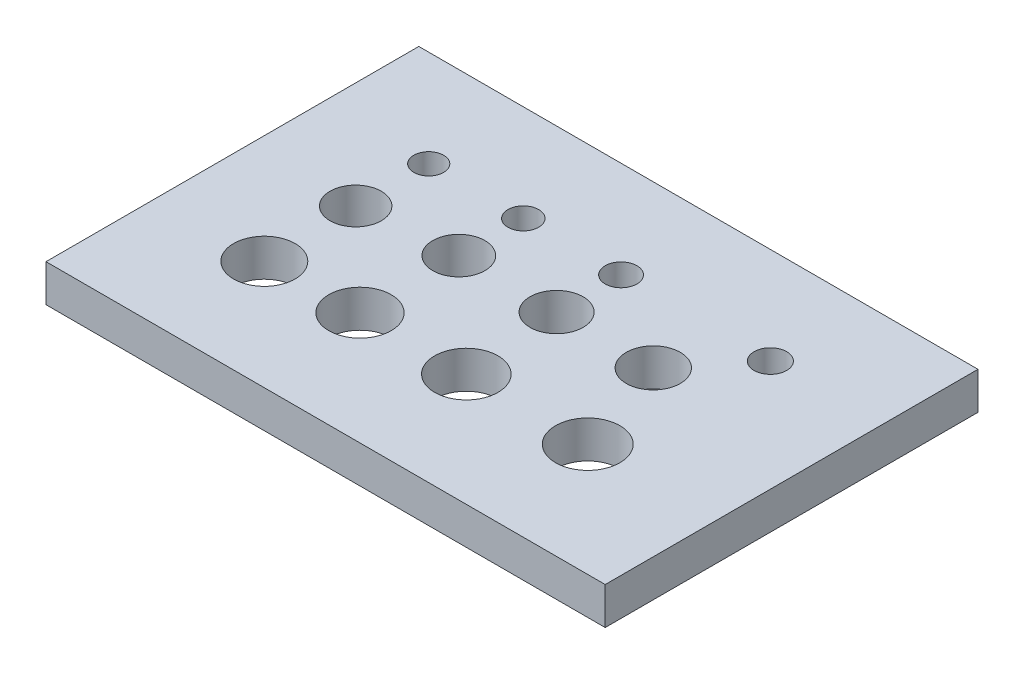
ISO-10303-21;
HEADER;
FILE_DESCRIPTION(('STEP AP214'),'2;1');
FILE_NAME('part.step','',(''),(''),'','','');
FILE_SCHEMA(('AUTOMOTIVE_DESIGN { 1 0 10303 214 1 1 1 1 }'));
ENDSEC;
DATA;
#1=APPLICATION_CONTEXT('core data for automotive mechanical design processes');
#2=APPLICATION_PROTOCOL_DEFINITION('international standard','automotive_design',2000,#1);
#3=PRODUCT_CONTEXT('',#1,'mechanical');
#4=PRODUCT('Part','Part','',(#3));
#5=PRODUCT_RELATED_PRODUCT_CATEGORY('part','',(#4));
#6=PRODUCT_DEFINITION_FORMATION('','',#4);
#7=PRODUCT_DEFINITION_CONTEXT('part definition',#1,'design');
#8=PRODUCT_DEFINITION('design','',#6,#7);
#9=PRODUCT_DEFINITION_SHAPE('','',#8);
#10=(LENGTH_UNIT() NAMED_UNIT(*) SI_UNIT(.MILLI.,.METRE.));
#11=(NAMED_UNIT(*) PLANE_ANGLE_UNIT() SI_UNIT($,.RADIAN.));
#12=(NAMED_UNIT(*) SI_UNIT($,.STERADIAN.) SOLID_ANGLE_UNIT());
#13=UNCERTAINTY_MEASURE_WITH_UNIT(LENGTH_MEASURE(1.E-05),#10,'distance_accuracy_value','');
#14=(GEOMETRIC_REPRESENTATION_CONTEXT(3) GLOBAL_UNCERTAINTY_ASSIGNED_CONTEXT((#13)) GLOBAL_UNIT_ASSIGNED_CONTEXT((#10,
#11,#12)) REPRESENTATION_CONTEXT('',''));
#15=CARTESIAN_POINT('',(0.,0.,0.));
#16=DIRECTION('',(0.,0.,1.));
#17=DIRECTION('',(1.,0.,0.));
#18=AXIS2_PLACEMENT_3D('',#15,#16,#17);
#19=CARTESIAN_POINT('',(0.,2.,0.));
#20=DIRECTION('',(0.,1.,0.));
#21=DIRECTION('',(0.,0.,1.));
#22=AXIS2_PLACEMENT_3D('',#19,#20,#21);
#23=PLANE('',#22);
#24=CARTESIAN_POINT('',(1.4985590778098,2.,3.94812680115274));
#25=DIRECTION('',(0.,1.,0.));
#26=DIRECTION('',(0.,0.,1.));
#27=AXIS2_PLACEMENT_3D('',#24,#25,#26);
#28=CIRCLE('',#27,1.7);
#29=CARTESIAN_POINT('',(1.4985590778098,2.,5.64812680115274));
#30=VERTEX_POINT('',#29);
#31=EDGE_CURVE('E175',#30,#30,#28,.T.);
#32=ORIENTED_EDGE('',*,*,#31,.F.);
#33=EDGE_LOOP('',(#32));
#34=FACE_BOUND('',#33,.T.);
#35=CARTESIAN_POINT('',(-9.1617638584646,2.,4.12478937080454));
#36=DIRECTION('',(0.,1.,0.));
#37=DIRECTION('',(0.,0.,1.));
#38=AXIS2_PLACEMENT_3D('',#35,#36,#37);
#39=CIRCLE('',#38,1.65);
#40=CARTESIAN_POINT('',(-9.1617638584646,2.,5.77478937080454));
#41=VERTEX_POINT('',#40);
#42=EDGE_CURVE('E163',#41,#41,#39,.T.);
#43=ORIENTED_EDGE('',*,*,#42,.F.);
#44=EDGE_LOOP('',(#43));
#45=FACE_BOUND('',#44,.T.);
#46=CARTESIAN_POINT('',(-9.27953890489914,2.,-0.89337175792507));
#47=DIRECTION('',(0.,1.,0.));
#48=DIRECTION('',(0.,0.,1.));
#49=AXIS2_PLACEMENT_3D('',#46,#47,#48);
#50=CIRCLE('',#49,1.375);
#51=CARTESIAN_POINT('',(-9.27953890489914,2.,0.481628242074929));
#52=VERTEX_POINT('',#51);
#53=EDGE_CURVE('E151',#52,#52,#50,.T.);
#54=ORIENTED_EDGE('',*,*,#53,.F.);
#55=EDGE_LOOP('',(#54));
#56=FACE_BOUND('',#55,.T.);
#57=CARTESIAN_POINT('',(-4.20749279538905,2.,-1.35446685878962));
#58=DIRECTION('',(0.,1.,0.));
#59=DIRECTION('',(0.,0.,1.));
#60=AXIS2_PLACEMENT_3D('',#57,#58,#59);
#61=CIRCLE('',#60,1.4);
#62=CARTESIAN_POINT('',(-4.20749279538905,2.,0.0455331412103754));
#63=VERTEX_POINT('',#62);
#64=EDGE_CURVE('E139',#63,#63,#61,.T.);
#65=ORIENTED_EDGE('',*,*,#64,.F.);
#66=EDGE_LOOP('',(#65));
#67=FACE_BOUND('',#66,.T.);
#68=CARTESIAN_POINT('',(1.03746397694524,2.,-4.81268011527377));
#69=DIRECTION('',(0.,1.,0.));
#70=DIRECTION('',(0.,0.,1.));
#71=AXIS2_PLACEMENT_3D('',#68,#69,#70);
#72=CIRCLE('',#71,0.85);
#73=CARTESIAN_POINT('',(1.03746397694524,2.,-3.96268011527377));
#74=VERTEX_POINT('',#73);
#75=EDGE_CURVE('E127',#74,#74,#72,.T.);
#76=ORIENTED_EDGE('',*,*,#75,.F.);
#77=EDGE_LOOP('',(#76));
#78=FACE_BOUND('',#77,.T.);
#79=CARTESIAN_POINT('',(-9.27953890489914,2.,-4.81268011527377));
#80=DIRECTION('',(0.,1.,0.));
#81=DIRECTION('',(0.,0.,1.));
#82=AXIS2_PLACEMENT_3D('',#79,#80,#81);
#83=CIRCLE('',#82,0.800000000000001);
#84=CARTESIAN_POINT('',(-9.27953890489914,2.,-4.01268011527377));
#85=VERTEX_POINT('',#84);
#86=EDGE_CURVE('E106',#85,#85,#83,.T.);
#87=ORIENTED_EDGE('',*,*,#86,.F.);
#88=EDGE_LOOP('',(#87));
#89=FACE_BOUND('',#88,.T.);
#90=DIRECTION('',(0.,0.,-1.));
#91=VECTOR('',#90,1.);
#92=CARTESIAN_POINT('',(15.,2.,-10.));
#93=LINE('',#92,#91);
#94=CARTESIAN_POINT('',(15.,2.,10.));
#95=VERTEX_POINT('',#94);
#96=CARTESIAN_POINT('',(15.,2.,-10.));
#97=VERTEX_POINT('',#96);
#98=EDGE_CURVE('E91',#95,#97,#93,.T.);
#99=ORIENTED_EDGE('',*,*,#98,.T.);
#100=DIRECTION('',(-1.,0.,0.));
#101=VECTOR('',#100,1.);
#102=CARTESIAN_POINT('',(-15.,2.,-10.));
#103=LINE('',#102,#101);
#104=CARTESIAN_POINT('',(-15.,2.,-10.));
#105=VERTEX_POINT('',#104);
#106=EDGE_CURVE('E86',#97,#105,#103,.T.);
#107=ORIENTED_EDGE('',*,*,#106,.T.);
#108=DIRECTION('',(0.,0.,1.));
#109=VECTOR('',#108,1.);
#110=CARTESIAN_POINT('',(-15.,2.,-10.));
#111=LINE('',#110,#109);
#112=CARTESIAN_POINT('',(-15.,2.,10.));
#113=VERTEX_POINT('',#112);
#114=EDGE_CURVE('E89',#105,#113,#111,.T.);
#115=ORIENTED_EDGE('',*,*,#114,.T.);
#116=DIRECTION('',(1.,0.,0.));
#117=VECTOR('',#116,1.);
#118=CARTESIAN_POINT('',(-15.,2.,10.));
#119=LINE('',#118,#117);
#120=EDGE_CURVE('E56',#113,#95,#119,.T.);
#121=ORIENTED_EDGE('',*,*,#120,.T.);
#122=EDGE_LOOP('',(#99,#107,#115,#121));
#123=FACE_BOUND('',#122,.T.);
#124=CARTESIAN_POINT('',(-4.20749279538905,2.,-4.81268011527377));
#125=DIRECTION('',(0.,1.,0.));
#126=DIRECTION('',(0.,0.,1.));
#127=AXIS2_PLACEMENT_3D('',#124,#125,#126);
#128=CIRCLE('',#127,0.825);
#129=CARTESIAN_POINT('',(-4.20749279538905,2.,-3.98768011527377));
#130=VERTEX_POINT('',#129);
#131=EDGE_CURVE('E121',#130,#130,#128,.T.);
#132=ORIENTED_EDGE('',*,*,#131,.F.);
#133=EDGE_LOOP('',(#132));
#134=FACE_BOUND('',#133,.T.);
#135=CARTESIAN_POINT('',(9.04899135446685,2.,-4.81268011527377));
#136=DIRECTION('',(0.,1.,0.));
#137=DIRECTION('',(0.,0.,1.));
#138=AXIS2_PLACEMENT_3D('',#135,#136,#137);
#139=CIRCLE('',#138,0.875);
#140=CARTESIAN_POINT('',(9.04899135446685,2.,-3.93768011527377));
#141=VERTEX_POINT('',#140);
#142=EDGE_CURVE('E133',#141,#141,#139,.T.);
#143=ORIENTED_EDGE('',*,*,#142,.F.);
#144=EDGE_LOOP('',(#143));
#145=FACE_BOUND('',#144,.T.);
#146=CARTESIAN_POINT('',(1.03746397694524,2.,-1.35446685878962));
#147=DIRECTION('',(0.,1.,0.));
#148=DIRECTION('',(0.,0.,1.));
#149=AXIS2_PLACEMENT_3D('',#146,#147,#148);
#150=CIRCLE('',#149,1.425);
#151=CARTESIAN_POINT('',(1.03746397694524,2.,0.0705331412103752));
#152=VERTEX_POINT('',#151);
#153=EDGE_CURVE('E145',#152,#152,#150,.T.);
#154=ORIENTED_EDGE('',*,*,#153,.F.);
#155=EDGE_LOOP('',(#154));
#156=FACE_BOUND('',#155,.T.);
#157=CARTESIAN_POINT('',(6.22478386167147,2.,-1.35446685878962));
#158=DIRECTION('',(0.,1.,0.));
#159=DIRECTION('',(0.,0.,1.));
#160=AXIS2_PLACEMENT_3D('',#157,#158,#159);
#161=CIRCLE('',#160,1.45);
#162=CARTESIAN_POINT('',(6.22478386167147,2.,0.0955331412103751));
#163=VERTEX_POINT('',#162);
#164=EDGE_CURVE('E157',#163,#163,#161,.T.);
#165=ORIENTED_EDGE('',*,*,#164,.F.);
#166=EDGE_LOOP('',(#165));
#167=FACE_BOUND('',#166,.T.);
#168=CARTESIAN_POINT('',(-4.20749279538905,2.,3.94812680115274));
#169=DIRECTION('',(0.,1.,0.));
#170=DIRECTION('',(0.,0.,1.));
#171=AXIS2_PLACEMENT_3D('',#168,#169,#170);
#172=CIRCLE('',#171,1.675);
#173=CARTESIAN_POINT('',(-4.20749279538905,2.,5.62312680115274));
#174=VERTEX_POINT('',#173);
#175=EDGE_CURVE('E169',#174,#174,#172,.T.);
#176=ORIENTED_EDGE('',*,*,#175,.F.);
#177=EDGE_LOOP('',(#176));
#178=FACE_BOUND('',#177,.T.);
#179=CARTESIAN_POINT('',(8.01152737752161,2.,3.94812680115274));
#180=DIRECTION('',(0.,1.,0.));
#181=DIRECTION('',(0.,0.,1.));
#182=AXIS2_PLACEMENT_3D('',#179,#180,#181);
#183=CIRCLE('',#182,1.725);
#184=CARTESIAN_POINT('',(8.01152737752161,2.,5.67312680115274));
#185=VERTEX_POINT('',#184);
#186=EDGE_CURVE('E181',#185,#185,#183,.T.);
#187=ORIENTED_EDGE('',*,*,#186,.F.);
#188=EDGE_LOOP('',(#187));
#189=FACE_BOUND('',#188,.T.);
#190=ADVANCED_FACE('F39',(#34,#45,#56,#67,#78,#89,#123,#134,#145,#156,#167,#178,#189),#23,.T.);
#191=CARTESIAN_POINT('',(0.,0.,0.));
#192=DIRECTION('',(0.,1.,0.));
#193=DIRECTION('',(0.,0.,1.));
#194=AXIS2_PLACEMENT_3D('',#191,#192,#193);
#195=PLANE('',#194);
#196=DIRECTION('',(0.,0.,-1.));
#197=VECTOR('',#196,1.);
#198=CARTESIAN_POINT('',(15.,0.,-10.));
#199=LINE('',#198,#197);
#200=CARTESIAN_POINT('',(15.,0.,10.));
#201=VERTEX_POINT('',#200);
#202=CARTESIAN_POINT('',(15.,0.,-10.));
#203=VERTEX_POINT('',#202);
#204=EDGE_CURVE('E103',#201,#203,#199,.T.);
#205=ORIENTED_EDGE('',*,*,#204,.F.);
#206=DIRECTION('',(1.,0.,0.));
#207=VECTOR('',#206,1.);
#208=CARTESIAN_POINT('',(-15.,0.,10.));
#209=LINE('',#208,#207);
#210=CARTESIAN_POINT('',(-15.,0.,10.));
#211=VERTEX_POINT('',#210);
#212=EDGE_CURVE('E79',#211,#201,#209,.T.);
#213=ORIENTED_EDGE('',*,*,#212,.F.);
#214=DIRECTION('',(0.,0.,1.));
#215=VECTOR('',#214,1.);
#216=CARTESIAN_POINT('',(-15.,0.,-10.));
#217=LINE('',#216,#215);
#218=CARTESIAN_POINT('',(-15.,0.,-10.));
#219=VERTEX_POINT('',#218);
#220=EDGE_CURVE('E73',#219,#211,#217,.T.);
#221=ORIENTED_EDGE('',*,*,#220,.F.);
#222=DIRECTION('',(-1.,0.,0.));
#223=VECTOR('',#222,1.);
#224=CARTESIAN_POINT('',(-15.,0.,-10.));
#225=LINE('',#224,#223);
#226=EDGE_CURVE('E95',#203,#219,#225,.T.);
#227=ORIENTED_EDGE('',*,*,#226,.F.);
#228=EDGE_LOOP('',(#205,#213,#221,#227));
#229=FACE_BOUND('',#228,.T.);
#230=CARTESIAN_POINT('',(-9.27953890489914,0.,-4.81268011527377));
#231=DIRECTION('',(0.,1.,0.));
#232=DIRECTION('',(0.,0.,1.));
#233=AXIS2_PLACEMENT_3D('',#230,#231,#232);
#234=CIRCLE('',#233,0.800000000000001);
#235=CARTESIAN_POINT('',(-9.27953890489914,0.,-4.01268011527377));
#236=VERTEX_POINT('',#235);
#237=EDGE_CURVE('E118',#236,#236,#234,.T.);
#238=ORIENTED_EDGE('',*,*,#237,.T.);
#239=EDGE_LOOP('',(#238));
#240=FACE_BOUND('',#239,.T.);
#241=CARTESIAN_POINT('',(-4.20749279538905,0.,-4.81268011527377));
#242=DIRECTION('',(0.,1.,0.));
#243=DIRECTION('',(0.,0.,1.));
#244=AXIS2_PLACEMENT_3D('',#241,#242,#243);
#245=CIRCLE('',#244,0.825);
#246=CARTESIAN_POINT('',(-4.20749279538905,0.,-3.98768011527377));
#247=VERTEX_POINT('',#246);
#248=EDGE_CURVE('E124',#247,#247,#245,.T.);
#249=ORIENTED_EDGE('',*,*,#248,.T.);
#250=EDGE_LOOP('',(#249));
#251=FACE_BOUND('',#250,.T.);
#252=CARTESIAN_POINT('',(1.03746397694524,0.,-4.81268011527377));
#253=DIRECTION('',(0.,1.,0.));
#254=DIRECTION('',(0.,0.,1.));
#255=AXIS2_PLACEMENT_3D('',#252,#253,#254);
#256=CIRCLE('',#255,0.85);
#257=CARTESIAN_POINT('',(1.03746397694524,0.,-3.96268011527377));
#258=VERTEX_POINT('',#257);
#259=EDGE_CURVE('E130',#258,#258,#256,.T.);
#260=ORIENTED_EDGE('',*,*,#259,.T.);
#261=EDGE_LOOP('',(#260));
#262=FACE_BOUND('',#261,.T.);
#263=CARTESIAN_POINT('',(9.04899135446685,0.,-4.81268011527377));
#264=DIRECTION('',(0.,1.,0.));
#265=DIRECTION('',(0.,0.,1.));
#266=AXIS2_PLACEMENT_3D('',#263,#264,#265);
#267=CIRCLE('',#266,0.875);
#268=CARTESIAN_POINT('',(9.04899135446685,0.,-3.93768011527377));
#269=VERTEX_POINT('',#268);
#270=EDGE_CURVE('E136',#269,#269,#267,.T.);
#271=ORIENTED_EDGE('',*,*,#270,.T.);
#272=EDGE_LOOP('',(#271));
#273=FACE_BOUND('',#272,.T.);
#274=CARTESIAN_POINT('',(-4.20749279538905,0.,-1.35446685878962));
#275=DIRECTION('',(0.,1.,0.));
#276=DIRECTION('',(0.,0.,1.));
#277=AXIS2_PLACEMENT_3D('',#274,#275,#276);
#278=CIRCLE('',#277,1.4);
#279=CARTESIAN_POINT('',(-4.20749279538905,0.,0.0455331412103754));
#280=VERTEX_POINT('',#279);
#281=EDGE_CURVE('E142',#280,#280,#278,.T.);
#282=ORIENTED_EDGE('',*,*,#281,.T.);
#283=EDGE_LOOP('',(#282));
#284=FACE_BOUND('',#283,.T.);
#285=CARTESIAN_POINT('',(1.03746397694524,0.,-1.35446685878962));
#286=DIRECTION('',(0.,1.,0.));
#287=DIRECTION('',(0.,0.,1.));
#288=AXIS2_PLACEMENT_3D('',#285,#286,#287);
#289=CIRCLE('',#288,1.425);
#290=CARTESIAN_POINT('',(1.03746397694524,0.,0.0705331412103752));
#291=VERTEX_POINT('',#290);
#292=EDGE_CURVE('E148',#291,#291,#289,.T.);
#293=ORIENTED_EDGE('',*,*,#292,.T.);
#294=EDGE_LOOP('',(#293));
#295=FACE_BOUND('',#294,.T.);
#296=CARTESIAN_POINT('',(-9.27953890489914,0.,-0.89337175792507));
#297=DIRECTION('',(0.,1.,0.));
#298=DIRECTION('',(0.,0.,1.));
#299=AXIS2_PLACEMENT_3D('',#296,#297,#298);
#300=CIRCLE('',#299,1.375);
#301=CARTESIAN_POINT('',(-9.27953890489914,0.,0.481628242074929));
#302=VERTEX_POINT('',#301);
#303=EDGE_CURVE('E154',#302,#302,#300,.T.);
#304=ORIENTED_EDGE('',*,*,#303,.T.);
#305=EDGE_LOOP('',(#304));
#306=FACE_BOUND('',#305,.T.);
#307=CARTESIAN_POINT('',(6.22478386167147,0.,-1.35446685878962));
#308=DIRECTION('',(0.,1.,0.));
#309=DIRECTION('',(0.,0.,1.));
#310=AXIS2_PLACEMENT_3D('',#307,#308,#309);
#311=CIRCLE('',#310,1.45);
#312=CARTESIAN_POINT('',(6.22478386167147,0.,0.0955331412103751));
#313=VERTEX_POINT('',#312);
#314=EDGE_CURVE('E160',#313,#313,#311,.T.);
#315=ORIENTED_EDGE('',*,*,#314,.T.);
#316=EDGE_LOOP('',(#315));
#317=FACE_BOUND('',#316,.T.);
#318=CARTESIAN_POINT('',(-9.1617638584646,0.,4.12478937080454));
#319=DIRECTION('',(0.,1.,0.));
#320=DIRECTION('',(0.,0.,1.));
#321=AXIS2_PLACEMENT_3D('',#318,#319,#320);
#322=CIRCLE('',#321,1.65);
#323=CARTESIAN_POINT('',(-9.1617638584646,0.,5.77478937080454));
#324=VERTEX_POINT('',#323);
#325=EDGE_CURVE('E166',#324,#324,#322,.T.);
#326=ORIENTED_EDGE('',*,*,#325,.T.);
#327=EDGE_LOOP('',(#326));
#328=FACE_BOUND('',#327,.T.);
#329=CARTESIAN_POINT('',(-4.20749279538905,0.,3.94812680115274));
#330=DIRECTION('',(0.,1.,0.));
#331=DIRECTION('',(0.,0.,1.));
#332=AXIS2_PLACEMENT_3D('',#329,#330,#331);
#333=CIRCLE('',#332,1.675);
#334=CARTESIAN_POINT('',(-4.20749279538905,0.,5.62312680115274));
#335=VERTEX_POINT('',#334);
#336=EDGE_CURVE('E172',#335,#335,#333,.T.);
#337=ORIENTED_EDGE('',*,*,#336,.T.);
#338=EDGE_LOOP('',(#337));
#339=FACE_BOUND('',#338,.T.);
#340=CARTESIAN_POINT('',(1.4985590778098,0.,3.94812680115274));
#341=DIRECTION('',(0.,1.,0.));
#342=DIRECTION('',(0.,0.,1.));
#343=AXIS2_PLACEMENT_3D('',#340,#341,#342);
#344=CIRCLE('',#343,1.7);
#345=CARTESIAN_POINT('',(1.4985590778098,0.,5.64812680115274));
#346=VERTEX_POINT('',#345);
#347=EDGE_CURVE('E178',#346,#346,#344,.T.);
#348=ORIENTED_EDGE('',*,*,#347,.T.);
#349=EDGE_LOOP('',(#348));
#350=FACE_BOUND('',#349,.T.);
#351=CARTESIAN_POINT('',(8.01152737752161,0.,3.94812680115274));
#352=DIRECTION('',(0.,1.,0.));
#353=DIRECTION('',(0.,0.,1.));
#354=AXIS2_PLACEMENT_3D('',#351,#352,#353);
#355=CIRCLE('',#354,1.725);
#356=CARTESIAN_POINT('',(8.01152737752161,0.,5.67312680115274));
#357=VERTEX_POINT('',#356);
#358=EDGE_CURVE('E184',#357,#357,#355,.T.);
#359=ORIENTED_EDGE('',*,*,#358,.T.);
#360=EDGE_LOOP('',(#359));
#361=FACE_BOUND('',#360,.T.);
#362=ADVANCED_FACE('F114',(#229,#240,#251,#262,#273,#284,#295,#306,#317,#328,#339,#350,#361),
#195,.F.);
#363=CARTESIAN_POINT('',(15.,2.,-10.));
#364=DIRECTION('',(-1.,0.,0.));
#365=DIRECTION('',(0.,0.,1.));
#366=AXIS2_PLACEMENT_3D('',#363,#364,#365);
#367=PLANE('',#366);
#368=ORIENTED_EDGE('',*,*,#204,.T.);
#369=DIRECTION('',(0.,-1.,0.));
#370=VECTOR('',#369,1.);
#371=CARTESIAN_POINT('',(15.,2.,-10.));
#372=LINE('',#371,#370);
#373=EDGE_CURVE('E11',#97,#203,#372,.T.);
#374=ORIENTED_EDGE('',*,*,#373,.F.);
#375=ORIENTED_EDGE('',*,*,#98,.F.);
#376=DIRECTION('',(0.,-1.,0.));
#377=VECTOR('',#376,1.);
#378=CARTESIAN_POINT('',(15.,2.,10.));
#379=LINE('',#378,#377);
#380=EDGE_CURVE('E99',#95,#201,#379,.T.);
#381=ORIENTED_EDGE('',*,*,#380,.T.);
#382=EDGE_LOOP('',(#368,#374,#375,#381));
#383=FACE_BOUND('',#382,.T.);
#384=ADVANCED_FACE('F41',(#383),#367,.F.);
#385=CARTESIAN_POINT('',(-15.,2.,-10.));
#386=DIRECTION('',(0.,0.,1.));
#387=DIRECTION('',(1.,0.,0.));
#388=AXIS2_PLACEMENT_3D('',#385,#386,#387);
#389=PLANE('',#388);
#390=ORIENTED_EDGE('',*,*,#226,.T.);
#391=DIRECTION('',(0.,-1.,0.));
#392=VECTOR('',#391,1.);
#393=CARTESIAN_POINT('',(-15.,2.,-10.));
#394=LINE('',#393,#392);
#395=EDGE_CURVE('E48',#105,#219,#394,.T.);
#396=ORIENTED_EDGE('',*,*,#395,.F.);
#397=ORIENTED_EDGE('',*,*,#106,.F.);
#398=ORIENTED_EDGE('',*,*,#373,.T.);
#399=EDGE_LOOP('',(#390,#396,#397,#398));
#400=FACE_BOUND('',#399,.T.);
#401=ADVANCED_FACE('F94',(#400),#389,.F.);
#402=CARTESIAN_POINT('',(-15.,2.,-10.));
#403=DIRECTION('',(1.,0.,0.));
#404=DIRECTION('',(0.,0.,-1.));
#405=AXIS2_PLACEMENT_3D('',#402,#403,#404);
#406=PLANE('',#405);
#407=ORIENTED_EDGE('',*,*,#220,.T.);
#408=DIRECTION('',(0.,-1.,0.));
#409=VECTOR('',#408,1.);
#410=CARTESIAN_POINT('',(-15.,2.,10.));
#411=LINE('',#410,#409);
#412=EDGE_CURVE('E96',#113,#211,#411,.T.);
#413=ORIENTED_EDGE('',*,*,#412,.F.);
#414=ORIENTED_EDGE('',*,*,#114,.F.);
#415=ORIENTED_EDGE('',*,*,#395,.T.);
#416=EDGE_LOOP('',(#407,#413,#414,#415));
#417=FACE_BOUND('',#416,.T.);
#418=ADVANCED_FACE('F97',(#417),#406,.F.);
#419=CARTESIAN_POINT('',(-15.,2.,10.));
#420=DIRECTION('',(0.,0.,-1.));
#421=DIRECTION('',(-1.,0.,0.));
#422=AXIS2_PLACEMENT_3D('',#419,#420,#421);
#423=PLANE('',#422);
#424=ORIENTED_EDGE('',*,*,#212,.T.);
#425=ORIENTED_EDGE('',*,*,#380,.F.);
#426=ORIENTED_EDGE('',*,*,#120,.F.);
#427=ORIENTED_EDGE('',*,*,#412,.T.);
#428=EDGE_LOOP('',(#424,#425,#426,#427));
#429=FACE_BOUND('',#428,.T.);
#430=ADVANCED_FACE('F111',(#429),#423,.F.);
#431=CARTESIAN_POINT('',(-9.27953890489914,2.,-4.81268011527377));
#432=DIRECTION('',(0.,-1.,0.));
#433=DIRECTION('',(0.,0.,-1.));
#434=AXIS2_PLACEMENT_3D('',#431,#432,#433);
#435=CYLINDRICAL_SURFACE('',#434,0.800000000000001);
#436=ORIENTED_EDGE('',*,*,#86,.T.);
#437=EDGE_LOOP('',(#436));
#438=FACE_BOUND('',#437,.T.);
#439=ORIENTED_EDGE('',*,*,#237,.F.);
#440=EDGE_LOOP('',(#439));
#441=FACE_BOUND('',#440,.T.);
#442=ADVANCED_FACE('F203',(#438,#441),#435,.F.);
#443=CARTESIAN_POINT('',(-4.20749279538905,2.,-4.81268011527377));
#444=DIRECTION('',(0.,-1.,0.));
#445=DIRECTION('',(0.,0.,-1.));
#446=AXIS2_PLACEMENT_3D('',#443,#444,#445);
#447=CYLINDRICAL_SURFACE('',#446,0.825);
#448=ORIENTED_EDGE('',*,*,#131,.T.);
#449=EDGE_LOOP('',(#448));
#450=FACE_BOUND('',#449,.T.);
#451=ORIENTED_EDGE('',*,*,#248,.F.);
#452=EDGE_LOOP('',(#451));
#453=FACE_BOUND('',#452,.T.);
#454=ADVANCED_FACE('F257',(#450,#453),#447,.F.);
#455=CARTESIAN_POINT('',(1.03746397694524,2.,-4.81268011527377));
#456=DIRECTION('',(0.,-1.,0.));
#457=DIRECTION('',(0.,0.,-1.));
#458=AXIS2_PLACEMENT_3D('',#455,#456,#457);
#459=CYLINDRICAL_SURFACE('',#458,0.85);
#460=ORIENTED_EDGE('',*,*,#75,.T.);
#461=EDGE_LOOP('',(#460));
#462=FACE_BOUND('',#461,.T.);
#463=ORIENTED_EDGE('',*,*,#259,.F.);
#464=EDGE_LOOP('',(#463));
#465=FACE_BOUND('',#464,.T.);
#466=ADVANCED_FACE('F266',(#462,#465),#459,.F.);
#467=CARTESIAN_POINT('',(9.04899135446685,2.,-4.81268011527377));
#468=DIRECTION('',(0.,-1.,0.));
#469=DIRECTION('',(0.,0.,-1.));
#470=AXIS2_PLACEMENT_3D('',#467,#468,#469);
#471=CYLINDRICAL_SURFACE('',#470,0.875);
#472=ORIENTED_EDGE('',*,*,#142,.T.);
#473=EDGE_LOOP('',(#472));
#474=FACE_BOUND('',#473,.T.);
#475=ORIENTED_EDGE('',*,*,#270,.F.);
#476=EDGE_LOOP('',(#475));
#477=FACE_BOUND('',#476,.T.);
#478=ADVANCED_FACE('F275',(#474,#477),#471,.F.);
#479=CARTESIAN_POINT('',(-4.20749279538905,2.,-1.35446685878962));
#480=DIRECTION('',(0.,-1.,0.));
#481=DIRECTION('',(0.,0.,-1.));
#482=AXIS2_PLACEMENT_3D('',#479,#480,#481);
#483=CYLINDRICAL_SURFACE('',#482,1.4);
#484=ORIENTED_EDGE('',*,*,#64,.T.);
#485=EDGE_LOOP('',(#484));
#486=FACE_BOUND('',#485,.T.);
#487=ORIENTED_EDGE('',*,*,#281,.F.);
#488=EDGE_LOOP('',(#487));
#489=FACE_BOUND('',#488,.T.);
#490=ADVANCED_FACE('F285',(#486,#489),#483,.F.);
#491=CARTESIAN_POINT('',(1.03746397694524,2.,-1.35446685878962));
#492=DIRECTION('',(0.,-1.,0.));
#493=DIRECTION('',(0.,0.,-1.));
#494=AXIS2_PLACEMENT_3D('',#491,#492,#493);
#495=CYLINDRICAL_SURFACE('',#494,1.425);
#496=ORIENTED_EDGE('',*,*,#153,.T.);
#497=EDGE_LOOP('',(#496));
#498=FACE_BOUND('',#497,.T.);
#499=ORIENTED_EDGE('',*,*,#292,.F.);
#500=EDGE_LOOP('',(#499));
#501=FACE_BOUND('',#500,.T.);
#502=ADVANCED_FACE('F295',(#498,#501),#495,.F.);
#503=CARTESIAN_POINT('',(-9.27953890489914,2.,-0.89337175792507));
#504=DIRECTION('',(0.,-1.,0.));
#505=DIRECTION('',(0.,0.,-1.));
#506=AXIS2_PLACEMENT_3D('',#503,#504,#505);
#507=CYLINDRICAL_SURFACE('',#506,1.375);
#508=ORIENTED_EDGE('',*,*,#53,.T.);
#509=EDGE_LOOP('',(#508));
#510=FACE_BOUND('',#509,.T.);
#511=ORIENTED_EDGE('',*,*,#303,.F.);
#512=EDGE_LOOP('',(#511));
#513=FACE_BOUND('',#512,.T.);
#514=ADVANCED_FACE('F305',(#510,#513),#507,.F.);
#515=CARTESIAN_POINT('',(6.22478386167147,2.,-1.35446685878962));
#516=DIRECTION('',(0.,-1.,0.));
#517=DIRECTION('',(0.,0.,-1.));
#518=AXIS2_PLACEMENT_3D('',#515,#516,#517);
#519=CYLINDRICAL_SURFACE('',#518,1.45);
#520=ORIENTED_EDGE('',*,*,#164,.T.);
#521=EDGE_LOOP('',(#520));
#522=FACE_BOUND('',#521,.T.);
#523=ORIENTED_EDGE('',*,*,#314,.F.);
#524=EDGE_LOOP('',(#523));
#525=FACE_BOUND('',#524,.T.);
#526=ADVANCED_FACE('F315',(#522,#525),#519,.F.);
#527=CARTESIAN_POINT('',(-9.1617638584646,2.,4.12478937080454));
#528=DIRECTION('',(0.,-1.,0.));
#529=DIRECTION('',(0.,0.,-1.));
#530=AXIS2_PLACEMENT_3D('',#527,#528,#529);
#531=CYLINDRICAL_SURFACE('',#530,1.65);
#532=ORIENTED_EDGE('',*,*,#42,.T.);
#533=EDGE_LOOP('',(#532));
#534=FACE_BOUND('',#533,.T.);
#535=ORIENTED_EDGE('',*,*,#325,.F.);
#536=EDGE_LOOP('',(#535));
#537=FACE_BOUND('',#536,.T.);
#538=ADVANCED_FACE('F325',(#534,#537),#531,.F.);
#539=CARTESIAN_POINT('',(-4.20749279538905,2.,3.94812680115274));
#540=DIRECTION('',(0.,-1.,0.));
#541=DIRECTION('',(0.,0.,-1.));
#542=AXIS2_PLACEMENT_3D('',#539,#540,#541);
#543=CYLINDRICAL_SURFACE('',#542,1.675);
#544=ORIENTED_EDGE('',*,*,#175,.T.);
#545=EDGE_LOOP('',(#544));
#546=FACE_BOUND('',#545,.T.);
#547=ORIENTED_EDGE('',*,*,#336,.F.);
#548=EDGE_LOOP('',(#547));
#549=FACE_BOUND('',#548,.T.);
#550=ADVANCED_FACE('F335',(#546,#549),#543,.F.);
#551=CARTESIAN_POINT('',(1.4985590778098,2.,3.94812680115274));
#552=DIRECTION('',(0.,-1.,0.));
#553=DIRECTION('',(0.,0.,-1.));
#554=AXIS2_PLACEMENT_3D('',#551,#552,#553);
#555=CYLINDRICAL_SURFACE('',#554,1.7);
#556=ORIENTED_EDGE('',*,*,#31,.T.);
#557=EDGE_LOOP('',(#556));
#558=FACE_BOUND('',#557,.T.);
#559=ORIENTED_EDGE('',*,*,#347,.F.);
#560=EDGE_LOOP('',(#559));
#561=FACE_BOUND('',#560,.T.);
#562=ADVANCED_FACE('F345',(#558,#561),#555,.F.);
#563=CARTESIAN_POINT('',(8.01152737752161,2.,3.94812680115274));
#564=DIRECTION('',(0.,-1.,0.));
#565=DIRECTION('',(0.,0.,-1.));
#566=AXIS2_PLACEMENT_3D('',#563,#564,#565);
#567=CYLINDRICAL_SURFACE('',#566,1.725);
#568=ORIENTED_EDGE('',*,*,#186,.T.);
#569=EDGE_LOOP('',(#568));
#570=FACE_BOUND('',#569,.T.);
#571=ORIENTED_EDGE('',*,*,#358,.F.);
#572=EDGE_LOOP('',(#571));
#573=FACE_BOUND('',#572,.T.);
#574=ADVANCED_FACE('F190',(#570,#573),#567,.F.);
#575=CLOSED_SHELL('',(#190,#362,#384,#401,#418,#430,#442,#454,#466,#478,#490,#502,#514,#526,
#538,#550,#562,#574));
#576=MANIFOLD_SOLID_BREP('B2',#575);
#577=ADVANCED_BREP_SHAPE_REPRESENTATION('',(#18,#576),#14);
#578=SHAPE_DEFINITION_REPRESENTATION(#9,#577);
ENDSEC;
END-ISO-10303-21;
